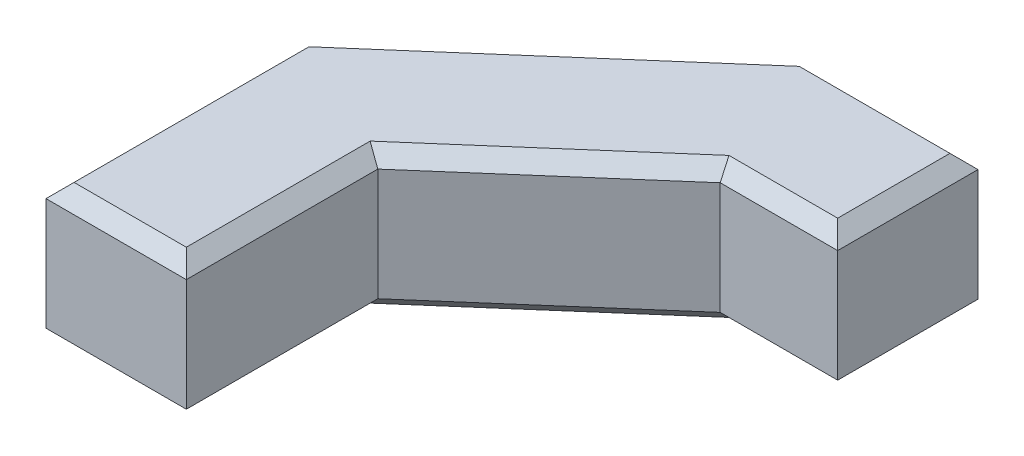
ISO-10303-21;
HEADER;
FILE_DESCRIPTION(('STEP AP214'),'2;1');
FILE_NAME('part.step','',(''),(''),'','','');
FILE_SCHEMA(('AUTOMOTIVE_DESIGN { 1 0 10303 214 1 1 1 1 }'));
ENDSEC;
DATA;
#1=APPLICATION_CONTEXT('core data for automotive mechanical design processes');
#2=APPLICATION_PROTOCOL_DEFINITION('international standard','automotive_design',2000,#1);
#3=PRODUCT_CONTEXT('',#1,'mechanical');
#4=PRODUCT('Part','Part','',(#3));
#5=PRODUCT_RELATED_PRODUCT_CATEGORY('part','',(#4));
#6=PRODUCT_DEFINITION_FORMATION('','',#4);
#7=PRODUCT_DEFINITION_CONTEXT('part definition',#1,'design');
#8=PRODUCT_DEFINITION('design','',#6,#7);
#9=PRODUCT_DEFINITION_SHAPE('','',#8);
#10=(LENGTH_UNIT() NAMED_UNIT(*) SI_UNIT(.MILLI.,.METRE.));
#11=(NAMED_UNIT(*) PLANE_ANGLE_UNIT() SI_UNIT($,.RADIAN.));
#12=(NAMED_UNIT(*) SI_UNIT($,.STERADIAN.) SOLID_ANGLE_UNIT());
#13=UNCERTAINTY_MEASURE_WITH_UNIT(LENGTH_MEASURE(1.E-05),#10,'distance_accuracy_value','');
#14=(GEOMETRIC_REPRESENTATION_CONTEXT(3) GLOBAL_UNCERTAINTY_ASSIGNED_CONTEXT((#13)) GLOBAL_UNIT_ASSIGNED_CONTEXT((#10,
#11,#12)) REPRESENTATION_CONTEXT('',''));
#15=CARTESIAN_POINT('',(0.,0.,0.));
#16=DIRECTION('',(0.,0.,1.));
#17=DIRECTION('',(1.,0.,0.));
#18=AXIS2_PLACEMENT_3D('',#15,#16,#17);
#19=CARTESIAN_POINT('',(42.8304284585056,20.,-71.3481397014182));
#20=DIRECTION('',(-1.,0.,0.));
#21=DIRECTION('',(0.,0.,1.));
#22=AXIS2_PLACEMENT_3D('',#19,#20,#21);
#23=PLANE('',#22);
#24=DIRECTION('',(0.,-1.,0.));
#25=VECTOR('',#24,1.);
#26=CARTESIAN_POINT('',(42.8304284585056,20.,-71.3481397014182));
#27=LINE('',#26,#25);
#28=CARTESIAN_POINT('',(42.8304284585056,18.,-71.3481397014182));
#29=VERTEX_POINT('',#28);
#30=CARTESIAN_POINT('',(42.8304284585056,2.,-71.3481397014182));
#31=VERTEX_POINT('',#30);
#32=EDGE_CURVE('E323',#29,#31,#27,.T.);
#33=ORIENTED_EDGE('',*,*,#32,.T.);
#34=DIRECTION('',(0.,0.,-1.));
#35=VECTOR('',#34,1.);
#36=CARTESIAN_POINT('',(42.8304284585056,2.,-71.3481397014182));
#37=LINE('',#36,#35);
#38=CARTESIAN_POINT('',(42.8304284585056,2.,-91.3481397014182));
#39=VERTEX_POINT('',#38);
#40=EDGE_CURVE('E272',#31,#39,#37,.T.);
#41=ORIENTED_EDGE('',*,*,#40,.T.);
#42=DIRECTION('',(0.,-1.,0.));
#43=VECTOR('',#42,1.);
#44=CARTESIAN_POINT('',(42.8304284585056,20.,-91.3481397014182));
#45=LINE('',#44,#43);
#46=CARTESIAN_POINT('',(42.8304284585056,18.,-91.3481397014182));
#47=VERTEX_POINT('',#46);
#48=EDGE_CURVE('E187',#47,#39,#45,.T.);
#49=ORIENTED_EDGE('',*,*,#48,.F.);
#50=DIRECTION('',(0.,0.,1.));
#51=VECTOR('',#50,1.);
#52=CARTESIAN_POINT('',(42.8304284585056,18.,-71.3481397014182));
#53=LINE('',#52,#51);
#54=EDGE_CURVE('E269',#47,#29,#53,.T.);
#55=ORIENTED_EDGE('',*,*,#54,.T.);
#56=EDGE_LOOP('',(#33,#41,#49,#55));
#57=FACE_BOUND('',#56,.T.);
#58=ADVANCED_FACE('F47',(#57),#23,.F.);
#59=CARTESIAN_POINT('',(42.8304284585056,20.,-91.3481397014182));
#60=DIRECTION('',(0.,0.,1.));
#61=DIRECTION('',(1.,0.,0.));
#62=AXIS2_PLACEMENT_3D('',#59,#60,#61);
#63=PLANE('',#62);
#64=ORIENTED_EDGE('',*,*,#48,.T.);
#65=DIRECTION('',(-1.,0.,0.));
#66=VECTOR('',#65,1.);
#67=CARTESIAN_POINT('',(42.8304284585056,2.,-91.3481397014182));
#68=LINE('',#67,#66);
#69=CARTESIAN_POINT('',(18.6016761388408,2.,-91.3481397014182));
#70=VERTEX_POINT('',#69);
#71=EDGE_CURVE('E185',#39,#70,#68,.T.);
#72=ORIENTED_EDGE('',*,*,#71,.T.);
#73=DIRECTION('',(0.,-1.,0.));
#74=VECTOR('',#73,1.);
#75=CARTESIAN_POINT('',(18.6016761388408,20.,-91.3481397014182));
#76=LINE('',#75,#74);
#77=CARTESIAN_POINT('',(18.6016761388408,18.,-91.3481397014182));
#78=VERTEX_POINT('',#77);
#79=EDGE_CURVE('E166',#78,#70,#76,.T.);
#80=ORIENTED_EDGE('',*,*,#79,.F.);
#81=DIRECTION('',(1.,0.,0.));
#82=VECTOR('',#81,1.);
#83=CARTESIAN_POINT('',(42.8304284585056,18.,-91.3481397014182));
#84=LINE('',#83,#82);
#85=EDGE_CURVE('E182',#78,#47,#84,.T.);
#86=ORIENTED_EDGE('',*,*,#85,.T.);
#87=EDGE_LOOP('',(#64,#72,#80,#86));
#88=FACE_BOUND('',#87,.T.);
#89=ADVANCED_FACE('F180',(#88),#63,.F.);
#90=CARTESIAN_POINT('',(18.6016761388408,20.,-91.3481397014182));
#91=DIRECTION('',(0.656619898522705,0.,0.754221657647162));
#92=DIRECTION('',(0.754221657647162,0.,-0.656619898522705));
#93=AXIS2_PLACEMENT_3D('',#90,#91,#92);
#94=PLANE('',#93);
#95=ORIENTED_EDGE('',*,*,#79,.T.);
#96=DIRECTION('',(-0.754221657647162,0.,0.656619898522705));
#97=VECTOR('',#96,1.);
#98=CARTESIAN_POINT('',(18.6016761388408,2.,-91.3481397014182));
#99=LINE('',#98,#97);
#100=CARTESIAN_POINT('',(-20.,2.,-57.7418007530482));
#101=VERTEX_POINT('',#100);
#102=EDGE_CURVE('E174',#70,#101,#99,.T.);
#103=ORIENTED_EDGE('',*,*,#102,.T.);
#104=DIRECTION('',(0.,-1.,0.));
#105=VECTOR('',#104,1.);
#106=CARTESIAN_POINT('',(-20.,20.,-57.7418007530482));
#107=LINE('',#106,#105);
#108=CARTESIAN_POINT('',(-20.,18.,-57.7418007530482));
#109=VERTEX_POINT('',#108);
#110=EDGE_CURVE('E168',#109,#101,#107,.T.);
#111=ORIENTED_EDGE('',*,*,#110,.F.);
#112=DIRECTION('',(0.754221657647162,0.,-0.656619898522705));
#113=VECTOR('',#112,1.);
#114=CARTESIAN_POINT('',(18.6016761388408,18.,-91.3481397014182));
#115=LINE('',#114,#113);
#116=EDGE_CURVE('E163',#109,#78,#115,.T.);
#117=ORIENTED_EDGE('',*,*,#116,.T.);
#118=EDGE_LOOP('',(#95,#103,#111,#117));
#119=FACE_BOUND('',#118,.T.);
#120=ADVANCED_FACE('F165',(#119),#94,.F.);
#121=CARTESIAN_POINT('',(-20.,20.,-57.7418007530482));
#122=DIRECTION('',(1.,0.,0.));
#123=DIRECTION('',(0.,0.,-1.));
#124=AXIS2_PLACEMENT_3D('',#121,#122,#123);
#125=PLANE('',#124);
#126=ORIENTED_EDGE('',*,*,#110,.T.);
#127=DIRECTION('',(0.,0.,1.));
#128=VECTOR('',#127,1.);
#129=CARTESIAN_POINT('',(-20.,2.,-57.7418007530482));
#130=LINE('',#129,#128);
#131=CARTESIAN_POINT('',(-20.,2.,-21.3481397014182));
#132=VERTEX_POINT('',#131);
#133=EDGE_CURVE('E241',#101,#132,#130,.T.);
#134=ORIENTED_EDGE('',*,*,#133,.T.);
#135=DIRECTION('',(0.,-1.,0.));
#136=VECTOR('',#135,1.);
#137=CARTESIAN_POINT('',(-20.,20.,-21.3481397014182));
#138=LINE('',#137,#136);
#139=CARTESIAN_POINT('',(-20.,18.,-21.3481397014182));
#140=VERTEX_POINT('',#139);
#141=EDGE_CURVE('E355',#140,#132,#138,.T.);
#142=ORIENTED_EDGE('',*,*,#141,.F.);
#143=DIRECTION('',(0.,0.,-1.));
#144=VECTOR('',#143,1.);
#145=CARTESIAN_POINT('',(-20.,18.,-57.7418007530482));
#146=LINE('',#145,#144);
#147=EDGE_CURVE('E238',#140,#109,#146,.T.);
#148=ORIENTED_EDGE('',*,*,#147,.T.);
#149=EDGE_LOOP('',(#126,#134,#142,#148));
#150=FACE_BOUND('',#149,.T.);
#151=ADVANCED_FACE('F352',(#150),#125,.F.);
#152=CARTESIAN_POINT('',(-20.,20.,-21.3481397014182));
#153=DIRECTION('',(0.,0.,-1.));
#154=DIRECTION('',(-1.,0.,0.));
#155=AXIS2_PLACEMENT_3D('',#152,#153,#154);
#156=PLANE('',#155);
#157=ORIENTED_EDGE('',*,*,#141,.T.);
#158=DIRECTION('',(1.,0.,0.));
#159=VECTOR('',#158,1.);
#160=CARTESIAN_POINT('',(-20.,2.,-21.3481397014182));
#161=LINE('',#160,#159);
#162=CARTESIAN_POINT('',(0.,2.,-21.3481397014182));
#163=VERTEX_POINT('',#162);
#164=EDGE_CURVE('E247',#132,#163,#161,.T.);
#165=ORIENTED_EDGE('',*,*,#164,.T.);
#166=DIRECTION('',(0.,-1.,0.));
#167=VECTOR('',#166,1.);
#168=CARTESIAN_POINT('',(0.,20.,-21.3481397014182));
#169=LINE('',#168,#167);
#170=CARTESIAN_POINT('',(0.,18.,-21.3481397014182));
#171=VERTEX_POINT('',#170);
#172=EDGE_CURVE('E359',#171,#163,#169,.T.);
#173=ORIENTED_EDGE('',*,*,#172,.F.);
#174=DIRECTION('',(-1.,0.,0.));
#175=VECTOR('',#174,1.);
#176=CARTESIAN_POINT('',(-20.,18.,-21.3481397014182));
#177=LINE('',#176,#175);
#178=EDGE_CURVE('E244',#171,#140,#177,.T.);
#179=ORIENTED_EDGE('',*,*,#178,.T.);
#180=EDGE_LOOP('',(#157,#165,#173,#179));
#181=FACE_BOUND('',#180,.T.);
#182=ADVANCED_FACE('F409',(#181),#156,.F.);
#183=CARTESIAN_POINT('',(0.,20.,-21.3481397014182));
#184=DIRECTION('',(-1.,0.,0.));
#185=DIRECTION('',(0.,0.,1.));
#186=AXIS2_PLACEMENT_3D('',#183,#184,#185);
#187=PLANE('',#186);
#188=ORIENTED_EDGE('',*,*,#172,.T.);
#189=DIRECTION('',(0.,0.,-1.));
#190=VECTOR('',#189,1.);
#191=CARTESIAN_POINT('',(0.,2.,-21.3481397014182));
#192=LINE('',#191,#190);
#193=CARTESIAN_POINT('',(0.,2.,-48.6362520593525));
#194=VERTEX_POINT('',#193);
#195=EDGE_CURVE('E253',#163,#194,#192,.T.);
#196=ORIENTED_EDGE('',*,*,#195,.T.);
#197=DIRECTION('',(0.,-1.,0.));
#198=VECTOR('',#197,1.);
#199=CARTESIAN_POINT('',(0.,20.,-48.6362520593525));
#200=LINE('',#199,#198);
#201=CARTESIAN_POINT('',(0.,18.,-48.6362520593525));
#202=VERTEX_POINT('',#201);
#203=EDGE_CURVE('E365',#202,#194,#200,.T.);
#204=ORIENTED_EDGE('',*,*,#203,.F.);
#205=DIRECTION('',(0.,0.,1.));
#206=VECTOR('',#205,1.);
#207=CARTESIAN_POINT('',(0.,18.,-21.3481397014182));
#208=LINE('',#207,#206);
#209=EDGE_CURVE('E250',#202,#171,#208,.T.);
#210=ORIENTED_EDGE('',*,*,#209,.T.);
#211=EDGE_LOOP('',(#188,#196,#204,#210));
#212=FACE_BOUND('',#211,.T.);
#213=ADVANCED_FACE('F412',(#212),#187,.F.);
#214=CARTESIAN_POINT('',(0.,20.,-48.6362520593525));
#215=DIRECTION('',(-0.656619898522705,0.,-0.754221657647162));
#216=DIRECTION('',(-0.754221657647162,0.,0.656619898522705));
#217=AXIS2_PLACEMENT_3D('',#214,#215,#216);
#218=PLANE('',#217);
#219=ORIENTED_EDGE('',*,*,#203,.T.);
#220=DIRECTION('',(0.754221657647162,0.,-0.656619898522705));
#221=VECTOR('',#220,1.);
#222=CARTESIAN_POINT('',(0.,2.,-48.6362520593525));
#223=LINE('',#222,#221);
#224=CARTESIAN_POINT('',(26.0878441001168,2.,-71.3481397014182));
#225=VERTEX_POINT('',#224);
#226=EDGE_CURVE('E259',#194,#225,#223,.T.);
#227=ORIENTED_EDGE('',*,*,#226,.T.);
#228=DIRECTION('',(0.,-1.,0.));
#229=VECTOR('',#228,1.);
#230=CARTESIAN_POINT('',(26.0878441001168,20.,-71.3481397014182));
#231=LINE('',#230,#229);
#232=CARTESIAN_POINT('',(26.0878441001168,18.,-71.3481397014182));
#233=VERTEX_POINT('',#232);
#234=EDGE_CURVE('E371',#233,#225,#231,.T.);
#235=ORIENTED_EDGE('',*,*,#234,.F.);
#236=DIRECTION('',(-0.754221657647162,0.,0.656619898522705));
#237=VECTOR('',#236,1.);
#238=CARTESIAN_POINT('',(0.,18.,-48.6362520593525));
#239=LINE('',#238,#237);
#240=EDGE_CURVE('E256',#233,#202,#239,.T.);
#241=ORIENTED_EDGE('',*,*,#240,.T.);
#242=EDGE_LOOP('',(#219,#227,#235,#241));
#243=FACE_BOUND('',#242,.T.);
#244=ADVANCED_FACE('F426',(#243),#218,.F.);
#245=CARTESIAN_POINT('',(26.0878441001168,20.,-71.3481397014182));
#246=DIRECTION('',(0.,0.,-1.));
#247=DIRECTION('',(-1.,0.,0.));
#248=AXIS2_PLACEMENT_3D('',#245,#246,#247);
#249=PLANE('',#248);
#250=ORIENTED_EDGE('',*,*,#234,.T.);
#251=DIRECTION('',(1.,0.,0.));
#252=VECTOR('',#251,1.);
#253=CARTESIAN_POINT('',(26.0878441001168,2.,-71.3481397014182));
#254=LINE('',#253,#252);
#255=EDGE_CURVE('E266',#225,#31,#254,.T.);
#256=ORIENTED_EDGE('',*,*,#255,.T.);
#257=ORIENTED_EDGE('',*,*,#32,.F.);
#258=DIRECTION('',(-1.,0.,0.));
#259=VECTOR('',#258,1.);
#260=CARTESIAN_POINT('',(26.0878441001168,18.,-71.3481397014182));
#261=LINE('',#260,#259);
#262=EDGE_CURVE('E262',#29,#233,#261,.T.);
#263=ORIENTED_EDGE('',*,*,#262,.T.);
#264=EDGE_LOOP('',(#250,#256,#257,#263));
#265=FACE_BOUND('',#264,.T.);
#266=ADVANCED_FACE('F427',(#265),#249,.F.);
#267=CARTESIAN_POINT('',(0.,20.,0.));
#268=DIRECTION('',(0.,1.,0.));
#269=DIRECTION('',(0.,0.,1.));
#270=AXIS2_PLACEMENT_3D('',#267,#268,#269);
#271=PLANE('',#270);
#272=DIRECTION('',(0.754221657647162,0.,-0.656619898522705));
#273=VECTOR('',#272,1.);
#274=CARTESIAN_POINT('',(24.7746043030714,20.,-72.8565830167125));
#275=LINE('',#274,#273);
#276=CARTESIAN_POINT('',(-2.,20.,-49.5468069287221));
#277=VERTEX_POINT('',#276);
#278=CARTESIAN_POINT('',(25.3392273039892,20.,-73.3481397014182));
#279=VERTEX_POINT('',#278);
#280=EDGE_CURVE('E58',#277,#279,#275,.T.);
#281=ORIENTED_EDGE('',*,*,#280,.T.);
#282=DIRECTION('',(1.,0.,0.));
#283=VECTOR('',#282,1.);
#284=CARTESIAN_POINT('',(42.8304284585056,20.,-73.3481397014182));
#285=LINE('',#284,#283);
#286=CARTESIAN_POINT('',(40.8304284585056,20.,-73.3481397014182));
#287=VERTEX_POINT('',#286);
#288=EDGE_CURVE('E11',#279,#287,#285,.T.);
#289=ORIENTED_EDGE('',*,*,#288,.T.);
#290=DIRECTION('',(0.,0.,-1.));
#291=VECTOR('',#290,1.);
#292=CARTESIAN_POINT('',(40.8304284585056,20.,-91.3481397014182));
#293=LINE('',#292,#291);
#294=CARTESIAN_POINT('',(40.8304284585056,20.,-89.3481397014182));
#295=VERTEX_POINT('',#294);
#296=EDGE_CURVE('E275',#287,#295,#293,.T.);
#297=ORIENTED_EDGE('',*,*,#296,.T.);
#298=DIRECTION('',(-1.,0.,0.));
#299=VECTOR('',#298,1.);
#300=CARTESIAN_POINT('',(18.6016761388408,20.,-89.3481397014182));
#301=LINE('',#300,#299);
#302=CARTESIAN_POINT('',(19.3502929349684,20.,-89.3481397014182));
#303=VERTEX_POINT('',#302);
#304=EDGE_CURVE('E278',#295,#303,#301,.T.);
#305=ORIENTED_EDGE('',*,*,#304,.T.);
#306=DIRECTION('',(-0.754221657647162,0.,0.656619898522705));
#307=VECTOR('',#306,1.);
#308=CARTESIAN_POINT('',(-18.6867602029546,20.,-56.2333574377539));
#309=LINE('',#308,#307);
#310=CARTESIAN_POINT('',(-18.,20.,-56.8312458836786));
#311=VERTEX_POINT('',#310);
#312=EDGE_CURVE('E193',#303,#311,#309,.T.);
#313=ORIENTED_EDGE('',*,*,#312,.T.);
#314=DIRECTION('',(0.,0.,1.));
#315=VECTOR('',#314,1.);
#316=CARTESIAN_POINT('',(-18.,20.,-21.3481397014182));
#317=LINE('',#316,#315);
#318=CARTESIAN_POINT('',(-18.,20.,-23.3481397014182));
#319=VERTEX_POINT('',#318);
#320=EDGE_CURVE('E283',#311,#319,#317,.T.);
#321=ORIENTED_EDGE('',*,*,#320,.T.);
#322=DIRECTION('',(1.,0.,0.));
#323=VECTOR('',#322,1.);
#324=CARTESIAN_POINT('',(0.,20.,-23.3481397014182));
#325=LINE('',#324,#323);
#326=CARTESIAN_POINT('',(-2.,20.,-23.3481397014182));
#327=VERTEX_POINT('',#326);
#328=EDGE_CURVE('E286',#319,#327,#325,.T.);
#329=ORIENTED_EDGE('',*,*,#328,.T.);
#330=DIRECTION('',(0.,0.,-1.));
#331=VECTOR('',#330,1.);
#332=CARTESIAN_POINT('',(-2.,20.,-48.6362520593525));
#333=LINE('',#332,#331);
#334=EDGE_CURVE('E69',#327,#277,#333,.T.);
#335=ORIENTED_EDGE('',*,*,#334,.T.);
#336=EDGE_LOOP('',(#281,#289,#297,#305,#313,#321,#329,#335));
#337=FACE_BOUND('',#336,.T.);
#338=ADVANCED_FACE('F436',(#337),#271,.T.);
#339=CARTESIAN_POINT('',(0.,0.,0.));
#340=DIRECTION('',(0.,1.,0.));
#341=DIRECTION('',(0.,0.,1.));
#342=AXIS2_PLACEMENT_3D('',#339,#340,#341);
#343=PLANE('',#342);
#344=DIRECTION('',(0.754221657647162,0.,-0.656619898522705));
#345=VECTOR('',#344,1.);
#346=CARTESIAN_POINT('',(-35.9056272204167,0.,-41.2427368436007));
#347=LINE('',#346,#345);
#348=CARTESIAN_POINT('',(-18.,0.,-56.8312458836786));
#349=VERTEX_POINT('',#348);
#350=CARTESIAN_POINT('',(19.3502929349684,0.,-89.3481397014182));
#351=VERTEX_POINT('',#350);
#352=EDGE_CURVE('E230',#349,#351,#347,.T.);
#353=ORIENTED_EDGE('',*,*,#352,.T.);
#354=DIRECTION('',(1.,0.,0.));
#355=VECTOR('',#354,1.);
#356=CARTESIAN_POINT('',(0.,0.,-89.3481397014182));
#357=LINE('',#356,#355);
#358=CARTESIAN_POINT('',(40.8304284585055,0.,-89.3481397014182));
#359=VERTEX_POINT('',#358);
#360=EDGE_CURVE('E175',#351,#359,#357,.T.);
#361=ORIENTED_EDGE('',*,*,#360,.T.);
#362=DIRECTION('',(0.,0.,1.));
#363=VECTOR('',#362,1.);
#364=CARTESIAN_POINT('',(40.8304284585055,0.,0.));
#365=LINE('',#364,#363);
#366=CARTESIAN_POINT('',(40.8304284585055,0.,-73.3481397014182));
#367=VERTEX_POINT('',#366);
#368=EDGE_CURVE('E209',#359,#367,#365,.T.);
#369=ORIENTED_EDGE('',*,*,#368,.T.);
#370=DIRECTION('',(-1.,0.,0.));
#371=VECTOR('',#370,1.);
#372=CARTESIAN_POINT('',(0.,0.,-73.3481397014182));
#373=LINE('',#372,#371);
#374=CARTESIAN_POINT('',(25.3392273039892,0.,-73.3481397014182));
#375=VERTEX_POINT('',#374);
#376=EDGE_CURVE('E215',#367,#375,#373,.T.);
#377=ORIENTED_EDGE('',*,*,#376,.T.);
#378=DIRECTION('',(-0.754221657647162,0.,0.656619898522705));
#379=VECTOR('',#378,1.);
#380=CARTESIAN_POINT('',(-25.3997088440533,0.,-29.175190321246));
#381=LINE('',#380,#379);
#382=CARTESIAN_POINT('',(-2.00000000000002,0.,-49.5468069287221));
#383=VERTEX_POINT('',#382);
#384=EDGE_CURVE('E218',#375,#383,#381,.T.);
#385=ORIENTED_EDGE('',*,*,#384,.T.);
#386=DIRECTION('',(0.,0.,1.));
#387=VECTOR('',#386,1.);
#388=CARTESIAN_POINT('',(-2.00000000000002,0.,0.));
#389=LINE('',#388,#387);
#390=CARTESIAN_POINT('',(-2.00000000000002,0.,-23.3481397014182));
#391=VERTEX_POINT('',#390);
#392=EDGE_CURVE('E221',#383,#391,#389,.T.);
#393=ORIENTED_EDGE('',*,*,#392,.T.);
#394=DIRECTION('',(-1.,0.,0.));
#395=VECTOR('',#394,1.);
#396=CARTESIAN_POINT('',(0.,0.,-23.3481397014182));
#397=LINE('',#396,#395);
#398=CARTESIAN_POINT('',(-18.,0.,-23.3481397014182));
#399=VERTEX_POINT('',#398);
#400=EDGE_CURVE('E224',#391,#399,#397,.T.);
#401=ORIENTED_EDGE('',*,*,#400,.T.);
#402=DIRECTION('',(0.,0.,-1.));
#403=VECTOR('',#402,1.);
#404=CARTESIAN_POINT('',(-18.,0.,0.));
#405=LINE('',#404,#403);
#406=EDGE_CURVE('E227',#399,#349,#405,.T.);
#407=ORIENTED_EDGE('',*,*,#406,.T.);
#408=EDGE_LOOP('',(#353,#361,#369,#377,#385,#393,#401,#407));
#409=FACE_BOUND('',#408,.T.);
#410=ADVANCED_FACE('F438',(#409),#343,.F.);
#411=CARTESIAN_POINT('',(0.,2.,-21.3481397014182));
#412=DIRECTION('',(-0.707106781186545,0.70710678118655,0.));
#413=DIRECTION('',(0.,0.,-1.));
#414=AXIS2_PLACEMENT_3D('',#411,#412,#413);
#415=PLANE('',#414);
#416=DIRECTION('',(-0.577350269189627,-0.577350269189623,-0.577350269189627));
#417=VECTOR('',#416,1.);
#418=CARTESIAN_POINT('',(0.,2.,-21.3481397014182));
#419=LINE('',#418,#417);
#420=EDGE_CURVE('E315',#391,#163,#419,.F.);
#421=ORIENTED_EDGE('',*,*,#420,.F.);
#422=ORIENTED_EDGE('',*,*,#392,.F.);
#423=DIRECTION('',(-0.673087503677067,-0.673087503677062,-0.306441551992473));
#424=VECTOR('',#423,1.);
#425=CARTESIAN_POINT('',(5.62850006504052,7.62850006504048,-46.0737229886178));
#426=LINE('',#425,#424);
#427=EDGE_CURVE('E319',#194,#383,#426,.T.);
#428=ORIENTED_EDGE('',*,*,#427,.F.);
#429=ORIENTED_EDGE('',*,*,#195,.F.);
#430=EDGE_LOOP('',(#421,#422,#428,#429));
#431=FACE_BOUND('',#430,.T.);
#432=ADVANCED_FACE('F417',(#431),#415,.F.);
#433=CARTESIAN_POINT('',(0.,2.,-48.6362520593525));
#434=DIRECTION('',(-0.464300382907425,0.707106781186551,-0.533315248640064));
#435=DIRECTION('',(0.754221657647162,0.,-0.656619898522705));
#436=AXIS2_PLACEMENT_3D('',#433,#434,#435);
#437=PLANE('',#436);
#438=ORIENTED_EDGE('',*,*,#427,.T.);
#439=ORIENTED_EDGE('',*,*,#384,.F.);
#440=DIRECTION('',(-0.255865570063542,-0.683568873653582,-0.683568873653586));
#441=VECTOR('',#440,1.);
#442=CARTESIAN_POINT('',(28.3522949119088,8.04969277607849,-65.2984469253396));
#443=LINE('',#442,#441);
#444=EDGE_CURVE('E311',#225,#375,#443,.T.);
#445=ORIENTED_EDGE('',*,*,#444,.F.);
#446=ORIENTED_EDGE('',*,*,#226,.F.);
#447=EDGE_LOOP('',(#438,#439,#445,#446));
#448=FACE_BOUND('',#447,.T.);
#449=ADVANCED_FACE('F423',(#448),#437,.F.);
#450=CARTESIAN_POINT('',(-20.,2.,-21.3481397014182));
#451=DIRECTION('',(0.,0.70710678118655,-0.707106781186545));
#452=DIRECTION('',(1.,0.,0.));
#453=AXIS2_PLACEMENT_3D('',#450,#451,#452);
#454=PLANE('',#453);
#455=ORIENTED_EDGE('',*,*,#420,.T.);
#456=ORIENTED_EDGE('',*,*,#164,.F.);
#457=DIRECTION('',(0.577350269189627,-0.577350269189623,-0.577350269189627));
#458=VECTOR('',#457,1.);
#459=CARTESIAN_POINT('',(-20.,2.,-21.3481397014182));
#460=LINE('',#459,#458);
#461=EDGE_CURVE('E307',#399,#132,#460,.F.);
#462=ORIENTED_EDGE('',*,*,#461,.F.);
#463=ORIENTED_EDGE('',*,*,#400,.F.);
#464=EDGE_LOOP('',(#455,#456,#462,#463));
#465=FACE_BOUND('',#464,.T.);
#466=ADVANCED_FACE('F406',(#465),#454,.F.);
#467=CARTESIAN_POINT('',(26.0878441001168,2.,-71.3481397014182));
#468=DIRECTION('',(0.,0.70710678118655,-0.707106781186545));
#469=DIRECTION('',(1.,0.,0.));
#470=AXIS2_PLACEMENT_3D('',#467,#468,#469);
#471=PLANE('',#470);
#472=ORIENTED_EDGE('',*,*,#444,.T.);
#473=ORIENTED_EDGE('',*,*,#376,.F.);
#474=DIRECTION('',(-0.577350269189627,-0.577350269189623,-0.577350269189627));
#475=VECTOR('',#474,1.);
#476=CARTESIAN_POINT('',(42.8304284585056,2.,-71.3481397014182));
#477=LINE('',#476,#475);
#478=EDGE_CURVE('E303',#31,#367,#477,.T.);
#479=ORIENTED_EDGE('',*,*,#478,.F.);
#480=ORIENTED_EDGE('',*,*,#255,.F.);
#481=EDGE_LOOP('',(#472,#473,#479,#480));
#482=FACE_BOUND('',#481,.T.);
#483=ADVANCED_FACE('F386',(#482),#471,.F.);
#484=CARTESIAN_POINT('',(-20.,2.,-57.7418007530482));
#485=DIRECTION('',(0.707106781186545,0.70710678118655,0.));
#486=DIRECTION('',(0.,0.,1.));
#487=AXIS2_PLACEMENT_3D('',#484,#485,#486);
#488=PLANE('',#487);
#489=ORIENTED_EDGE('',*,*,#461,.T.);
#490=ORIENTED_EDGE('',*,*,#133,.F.);
#491=DIRECTION('',(0.673087503677067,-0.673087503677062,0.306441551992474));
#492=VECTOR('',#491,1.);
#493=CARTESIAN_POINT('',(-20.,2.,-57.7418007530482));
#494=LINE('',#493,#492);
#495=EDGE_CURVE('E299',#349,#101,#494,.F.);
#496=ORIENTED_EDGE('',*,*,#495,.F.);
#497=ORIENTED_EDGE('',*,*,#406,.F.);
#498=EDGE_LOOP('',(#489,#490,#496,#497));
#499=FACE_BOUND('',#498,.T.);
#500=ADVANCED_FACE('F402',(#499),#488,.F.);
#501=CARTESIAN_POINT('',(42.8304284585056,2.,-71.3481397014182));
#502=DIRECTION('',(-0.707106781186545,0.70710678118655,0.));
#503=DIRECTION('',(0.,0.,-1.));
#504=AXIS2_PLACEMENT_3D('',#501,#502,#503);
#505=PLANE('',#504);
#506=ORIENTED_EDGE('',*,*,#478,.T.);
#507=ORIENTED_EDGE('',*,*,#368,.F.);
#508=DIRECTION('',(0.577350269189627,0.577350269189623,-0.577350269189627));
#509=VECTOR('',#508,1.);
#510=CARTESIAN_POINT('',(36.1637617918389,-4.66666666666665,-84.6814730347515));
#511=LINE('',#510,#509);
#512=EDGE_CURVE('E296',#39,#359,#511,.F.);
#513=ORIENTED_EDGE('',*,*,#512,.F.);
#514=ORIENTED_EDGE('',*,*,#40,.F.);
#515=EDGE_LOOP('',(#506,#507,#513,#514));
#516=FACE_BOUND('',#515,.T.);
#517=ADVANCED_FACE('F390',(#516),#505,.F.);
#518=CARTESIAN_POINT('',(18.6016761388408,2.,-91.3481397014182));
#519=DIRECTION('',(0.464300382907425,0.707106781186551,0.533315248640064));
#520=DIRECTION('',(-0.754221657647162,0.,0.656619898522705));
#521=AXIS2_PLACEMENT_3D('',#518,#519,#520);
#522=PLANE('',#521);
#523=ORIENTED_EDGE('',*,*,#495,.T.);
#524=ORIENTED_EDGE('',*,*,#102,.F.);
#525=DIRECTION('',(0.255865570063543,-0.683568873653581,0.683568873653586));
#526=VECTOR('',#525,1.);
#527=CARTESIAN_POINT('',(18.6016761388408,2.,-91.3481397014182));
#528=LINE('',#527,#526);
#529=EDGE_CURVE('E293',#351,#70,#528,.F.);
#530=ORIENTED_EDGE('',*,*,#529,.F.);
#531=ORIENTED_EDGE('',*,*,#352,.F.);
#532=EDGE_LOOP('',(#523,#524,#530,#531));
#533=FACE_BOUND('',#532,.T.);
#534=ADVANCED_FACE('F398',(#533),#522,.F.);
#535=CARTESIAN_POINT('',(42.8304284585056,2.,-91.3481397014182));
#536=DIRECTION('',(0.,0.70710678118655,0.707106781186545));
#537=DIRECTION('',(-1.,0.,0.));
#538=AXIS2_PLACEMENT_3D('',#535,#536,#537);
#539=PLANE('',#538);
#540=ORIENTED_EDGE('',*,*,#512,.T.);
#541=ORIENTED_EDGE('',*,*,#360,.F.);
#542=ORIENTED_EDGE('',*,*,#529,.T.);
#543=ORIENTED_EDGE('',*,*,#71,.F.);
#544=EDGE_LOOP('',(#540,#541,#542,#543));
#545=FACE_BOUND('',#544,.T.);
#546=ADVANCED_FACE('F393',(#545),#539,.F.);
#547=CARTESIAN_POINT('',(-18.,20.,0.));
#548=DIRECTION('',(-0.70710678118655,0.707106781186545,0.));
#549=DIRECTION('',(0.,0.,-1.));
#550=AXIS2_PLACEMENT_3D('',#547,#548,#549);
#551=PLANE('',#550);
#552=DIRECTION('',(0.673087503677061,0.673087503677066,0.306441551992477));
#553=VECTOR('',#552,1.);
#554=CARTESIAN_POINT('',(-22.896770164066,15.1032298359339,-59.0606348422156));
#555=LINE('',#554,#553);
#556=EDGE_CURVE('E337',#109,#311,#555,.T.);
#557=ORIENTED_EDGE('',*,*,#556,.F.);
#558=ORIENTED_EDGE('',*,*,#147,.F.);
#559=DIRECTION('',(0.577350269189624,0.577350269189628,-0.577350269189624));
#560=VECTOR('',#559,1.);
#561=CARTESIAN_POINT('',(-25.782713233806,12.2172867661939,-15.5654264676121));
#562=LINE('',#561,#560);
#563=EDGE_CURVE('E52',#319,#140,#562,.F.);
#564=ORIENTED_EDGE('',*,*,#563,.F.);
#565=ORIENTED_EDGE('',*,*,#320,.F.);
#566=EDGE_LOOP('',(#557,#558,#564,#565));
#567=FACE_BOUND('',#566,.T.);
#568=ADVANCED_FACE('F50',(#567),#551,.T.);
#569=CARTESIAN_POINT('',(0.,20.,-23.3481397014182));
#570=DIRECTION('',(0.,0.707106781186545,0.70710678118655));
#571=DIRECTION('',(-1.,0.,0.));
#572=AXIS2_PLACEMENT_3D('',#569,#570,#571);
#573=PLANE('',#572);
#574=ORIENTED_EDGE('',*,*,#563,.T.);
#575=ORIENTED_EDGE('',*,*,#178,.F.);
#576=DIRECTION('',(-0.577350269189624,0.577350269189628,-0.577350269189624));
#577=VECTOR('',#576,1.);
#578=CARTESIAN_POINT('',(-1.33333333333334,19.3333333333333,-22.6814730347515));
#579=LINE('',#578,#577);
#580=EDGE_CURVE('E197',#327,#171,#579,.F.);
#581=ORIENTED_EDGE('',*,*,#580,.F.);
#582=ORIENTED_EDGE('',*,*,#328,.F.);
#583=EDGE_LOOP('',(#574,#575,#581,#582));
#584=FACE_BOUND('',#583,.T.);
#585=ADVANCED_FACE('F345',(#584),#573,.T.);
#586=CARTESIAN_POINT('',(-35.9056272204167,20.,-41.2427368436007));
#587=DIRECTION('',(-0.464300382907427,0.707106781186549,-0.533315248640066));
#588=DIRECTION('',(0.754221657647162,0.,-0.656619898522705));
#589=AXIS2_PLACEMENT_3D('',#586,#587,#588);
#590=PLANE('',#589);
#591=ORIENTED_EDGE('',*,*,#556,.T.);
#592=ORIENTED_EDGE('',*,*,#312,.F.);
#593=DIRECTION('',(0.255865570063548,0.683568873653585,0.683568873653581));
#594=VECTOR('',#593,1.);
#595=CARTESIAN_POINT('',(18.0834836319239,16.6156001051608,-92.7325395962573));
#596=LINE('',#595,#594);
#597=EDGE_CURVE('E191',#78,#303,#596,.T.);
#598=ORIENTED_EDGE('',*,*,#597,.F.);
#599=ORIENTED_EDGE('',*,*,#116,.F.);
#600=EDGE_LOOP('',(#591,#592,#598,#599));
#601=FACE_BOUND('',#600,.T.);
#602=ADVANCED_FACE('F192',(#601),#590,.T.);
#603=CARTESIAN_POINT('',(-2.,20.,0.));
#604=DIRECTION('',(0.70710678118655,0.707106781186545,0.));
#605=DIRECTION('',(0.,0.,1.));
#606=AXIS2_PLACEMENT_3D('',#603,#604,#605);
#607=PLANE('',#606);
#608=ORIENTED_EDGE('',*,*,#580,.T.);
#609=ORIENTED_EDGE('',*,*,#209,.F.);
#610=DIRECTION('',(-0.673087503677062,0.673087503677067,-0.306441551992471));
#611=VECTOR('',#610,1.);
#612=CARTESIAN_POINT('',(-8.39927296066692,26.399272960667,-52.4602515061022));
#613=LINE('',#612,#611);
#614=EDGE_CURVE('E198',#277,#202,#613,.F.);
#615=ORIENTED_EDGE('',*,*,#614,.F.);
#616=ORIENTED_EDGE('',*,*,#334,.F.);
#617=EDGE_LOOP('',(#608,#609,#615,#616));
#618=FACE_BOUND('',#617,.T.);
#619=ADVANCED_FACE('F518',(#618),#607,.T.);
#620=CARTESIAN_POINT('',(0.,20.,-89.3481397014182));
#621=DIRECTION('',(0.,0.707106781186545,-0.70710678118655));
#622=DIRECTION('',(1.,0.,0.));
#623=AXIS2_PLACEMENT_3D('',#620,#621,#622);
#624=PLANE('',#623);
#625=ORIENTED_EDGE('',*,*,#597,.T.);
#626=ORIENTED_EDGE('',*,*,#304,.F.);
#627=DIRECTION('',(-0.577350269189624,0.577350269189628,0.577350269189624));
#628=VECTOR('',#627,1.);
#629=CARTESIAN_POINT('',(11.0477152246996,49.7827132338061,-59.5654264676123));
#630=LINE('',#629,#628);
#631=EDGE_CURVE('E203',#47,#295,#630,.T.);
#632=ORIENTED_EDGE('',*,*,#631,.F.);
#633=ORIENTED_EDGE('',*,*,#85,.F.);
#634=EDGE_LOOP('',(#625,#626,#632,#633));
#635=FACE_BOUND('',#634,.T.);
#636=ADVANCED_FACE('F201',(#635),#624,.T.);
#637=CARTESIAN_POINT('',(-25.3997088440533,20.,-29.175190321246));
#638=DIRECTION('',(0.464300382907429,0.707106781186546,0.533315248640068));
#639=DIRECTION('',(-0.754221657647162,0.,0.656619898522705));
#640=AXIS2_PLACEMENT_3D('',#637,#638,#639);
#641=PLANE('',#640);
#642=ORIENTED_EDGE('',*,*,#614,.T.);
#643=ORIENTED_EDGE('',*,*,#240,.F.);
#644=DIRECTION('',(-0.25586557006354,0.683568873653587,-0.683568873653582));
#645=VECTOR('',#644,1.);
#646=CARTESIAN_POINT('',(23.6803392970463,24.4318749339422,-77.7800146353603));
#647=LINE('',#646,#645);
#648=EDGE_CURVE('E327',#279,#233,#647,.F.);
#649=ORIENTED_EDGE('',*,*,#648,.F.);
#650=ORIENTED_EDGE('',*,*,#280,.F.);
#651=EDGE_LOOP('',(#642,#643,#649,#650));
#652=FACE_BOUND('',#651,.T.);
#653=ADVANCED_FACE('F506',(#652),#641,.T.);
#654=CARTESIAN_POINT('',(40.8304284585056,20.,0.));
#655=DIRECTION('',(0.70710678118655,0.707106781186545,0.));
#656=DIRECTION('',(0.,0.,1.));
#657=AXIS2_PLACEMENT_3D('',#654,#655,#656);
#658=PLANE('',#657);
#659=ORIENTED_EDGE('',*,*,#631,.T.);
#660=ORIENTED_EDGE('',*,*,#296,.F.);
#661=DIRECTION('',(0.577350269189624,-0.577350269189628,0.577350269189624));
#662=VECTOR('',#661,1.);
#663=CARTESIAN_POINT('',(65.2798083589782,-4.44937990047278,-48.8987598009456));
#664=LINE('',#663,#662);
#665=EDGE_CURVE('E324',#29,#287,#664,.F.);
#666=ORIENTED_EDGE('',*,*,#665,.F.);
#667=ORIENTED_EDGE('',*,*,#54,.F.);
#668=EDGE_LOOP('',(#659,#660,#666,#667));
#669=FACE_BOUND('',#668,.T.);
#670=ADVANCED_FACE('F435',(#669),#658,.T.);
#671=CARTESIAN_POINT('',(0.,20.,-73.3481397014182));
#672=DIRECTION('',(0.,0.707106781186545,0.70710678118655));
#673=DIRECTION('',(-1.,0.,0.));
#674=AXIS2_PLACEMENT_3D('',#671,#672,#673);
#675=PLANE('',#674);
#676=ORIENTED_EDGE('',*,*,#648,.T.);
#677=ORIENTED_EDGE('',*,*,#262,.F.);
#678=ORIENTED_EDGE('',*,*,#665,.T.);
#679=ORIENTED_EDGE('',*,*,#288,.F.);
#680=EDGE_LOOP('',(#676,#677,#678,#679));
#681=FACE_BOUND('',#680,.T.);
#682=ADVANCED_FACE('F430',(#681),#675,.T.);
#683=CLOSED_SHELL('',(#58,#89,#120,#151,#182,#213,#244,#266,#338,#410,#432,#449,#466,#483,#500,
#517,#534,#546,#568,#585,#602,#619,#636,#653,#670,#682));
#684=MANIFOLD_SOLID_BREP('B2',#683);
#685=ADVANCED_BREP_SHAPE_REPRESENTATION('',(#18,#684),#14);
#686=SHAPE_DEFINITION_REPRESENTATION(#9,#685);
ENDSEC;
END-ISO-10303-21;
